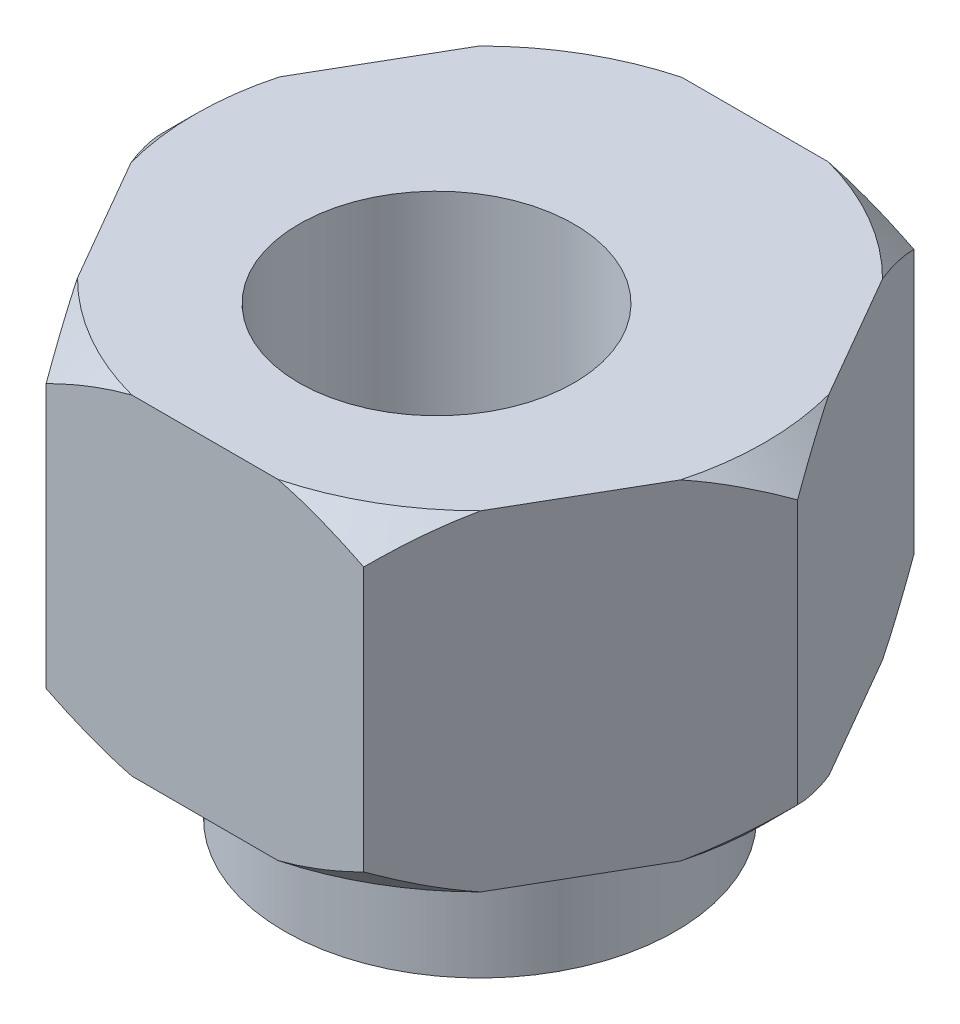
ISO-10303-21;
HEADER;
FILE_DESCRIPTION(('STEP AP214'),'2;1');
FILE_NAME('part.step','',(''),(''),'','','');
FILE_SCHEMA(('AUTOMOTIVE_DESIGN { 1 0 10303 214 1 1 1 1 }'));
ENDSEC;
DATA;
#1=APPLICATION_CONTEXT('core data for automotive mechanical design processes');
#2=APPLICATION_PROTOCOL_DEFINITION('international standard','automotive_design',2000,#1);
#3=PRODUCT_CONTEXT('',#1,'mechanical');
#4=PRODUCT('Part','Part','',(#3));
#5=PRODUCT_RELATED_PRODUCT_CATEGORY('part','',(#4));
#6=PRODUCT_DEFINITION_FORMATION('','',#4);
#7=PRODUCT_DEFINITION_CONTEXT('part definition',#1,'design');
#8=PRODUCT_DEFINITION('design','',#6,#7);
#9=PRODUCT_DEFINITION_SHAPE('','',#8);
#10=(LENGTH_UNIT() NAMED_UNIT(*) SI_UNIT(.MILLI.,.METRE.));
#11=(NAMED_UNIT(*) PLANE_ANGLE_UNIT() SI_UNIT($,.RADIAN.));
#12=(NAMED_UNIT(*) SI_UNIT($,.STERADIAN.) SOLID_ANGLE_UNIT());
#13=UNCERTAINTY_MEASURE_WITH_UNIT(LENGTH_MEASURE(1.E-05),#10,'distance_accuracy_value','');
#14=(GEOMETRIC_REPRESENTATION_CONTEXT(3) GLOBAL_UNCERTAINTY_ASSIGNED_CONTEXT((#13)) GLOBAL_UNIT_ASSIGNED_CONTEXT((#10,
#11,#12)) REPRESENTATION_CONTEXT('',''));
#15=CARTESIAN_POINT('',(0.,0.,0.));
#16=DIRECTION('',(0.,0.,1.));
#17=DIRECTION('',(1.,0.,0.));
#18=AXIS2_PLACEMENT_3D('',#15,#16,#17);
#19=CARTESIAN_POINT('',(0.,0.603600000033566,0.));
#20=DIRECTION('',(0.,1.,0.));
#21=DIRECTION('',(0.,0.,1.));
#22=AXIS2_PLACEMENT_3D('',#19,#20,#21);
#23=CONICAL_SURFACE('',#22,5.77710269197951,0.785398163397448);
#24=CARTESIAN_POINT('',(3.66583602411826,-4.45925382962046E-11,3.65058575400421));
#25=CARTESIAN_POINT('',(3.59819023816543,0.034740022256458,3.76775169219671));
#26=CARTESIAN_POINT('',(3.53117883640093,0.0741190546439248,3.88381884474099));
#27=CARTESIAN_POINT('',(3.39865378405298,0.160814558763776,4.11335896868467));
#28=CARTESIAN_POINT('',(3.33313646636913,0.20810850589876,4.22683829168825));
#29=CARTESIAN_POINT('',(3.20348247756349,0.309475567343877,4.45140558770323));
#30=CARTESIAN_POINT('',(3.13934511969438,0.363545213751609,4.56249475019585));
#31=CARTESIAN_POINT('',(3.01218041898829,0.477607203810078,4.78275047274827));
#32=CARTESIAN_POINT('',(2.94915669436118,0.537615735141677,4.89191076588474));
#33=CARTESIAN_POINT('',(2.88675134593849,0.599999999959958,5.0000000000167));
#34=B_SPLINE_CURVE_WITH_KNOTS('',3,(#24,#25,#26,#27,#28,#29,#30,#31,#32,#33),.UNSPECIFIED.,.F.,
.F.,(4,2,2,2,4),(0.,0.418851939634371,0.836531554095843,1.25399826048283,1.67263595625829),.UNSPECIFIED.);
#35=CARTESIAN_POINT('',(3.6658360240762,-2.29975708933372E-11,3.65058575408374));
#36=VERTEX_POINT('',#35);
#37=CARTESIAN_POINT('',(2.88675134595807,0.599999999955285,5.));
#38=VERTEX_POINT('',#37);
#39=EDGE_CURVE('E161',#36,#38,#34,.T.);
#40=ORIENTED_EDGE('',*,*,#39,.T.);
#41=CARTESIAN_POINT('',(2.88675134596664,0.599999999962989,4.99999999999376));
#42=CARTESIAN_POINT('',(2.76194064912218,0.537615735142946,4.99999999999775));
#43=CARTESIAN_POINT('',(2.63589319986819,0.477607203810566,4.9999999999994));
#44=CARTESIAN_POINT('',(2.38156379845602,0.363545213751467,5.0000000000006));
#45=CARTESIAN_POINT('',(2.25328908271759,0.309475567343881,5.00000000000017));
#46=CARTESIAN_POINT('',(1.99398110510648,0.208108505898969,4.99999999999983));
#47=CARTESIAN_POINT('',(1.8629464697392,0.160814558764041,4.99999999999991));
#48=CARTESIAN_POINT('',(1.59789636504229,0.0741190546438341,5.00000000000009));
#49=CARTESIAN_POINT('',(1.4638735615119,0.0347400222559553,5.00000000000017));
#50=CARTESIAN_POINT('',(1.32858198960276,-4.59149544066853E-11,5.));
#51=B_SPLINE_CURVE_WITH_KNOTS('',3,(#41,#42,#43,#44,#45,#46,#47,#48,#49,#50),.UNSPECIFIED.,.F.,
.F.,(4,2,2,2,4),(0.,0.418637695775641,0.836104402162777,1.25378401662423,1.67263595625861),.UNSPECIFIED.);
#52=CARTESIAN_POINT('',(1.32858198978154,0.,5.));
#53=VERTEX_POINT('',#52);
#54=EDGE_CURVE('E156',#38,#53,#51,.T.);
#55=ORIENTED_EDGE('',*,*,#54,.T.);
#56=CARTESIAN_POINT('',(0.,0.,0.));
#57=DIRECTION('',(0.,1.,0.));
#58=DIRECTION('',(0.,0.,1.));
#59=AXIS2_PLACEMENT_3D('',#56,#57,#58);
#60=CIRCLE('',#59,5.17350269194594);
#61=EDGE_CURVE('E21',#53,#36,#60,.T.);
#62=ORIENTED_EDGE('',*,*,#61,.T.);
#63=EDGE_LOOP('',(#40,#55,#62));
#64=FACE_BOUND('',#63,.T.);
#65=ADVANCED_FACE('F17',(#64),#23,.T.);
#66=CARTESIAN_POINT('',(0.,0.603600000033566,0.));
#67=DIRECTION('',(0.,1.,0.));
#68=DIRECTION('',(0.,0.,1.));
#69=AXIS2_PLACEMENT_3D('',#66,#67,#68);
#70=CONICAL_SURFACE('',#69,5.77710269197951,0.785398163397448);
#71=CARTESIAN_POINT('',(4.99441801372035,-4.45918489580247E-11,-1.34941424599245));
#72=CARTESIAN_POINT('',(5.06206379967688,0.0347400222564589,-1.23224830780208));
#73=CARTESIAN_POINT('',(5.1290752014429,0.074119054643926,-1.11618115525868));
#74=CARTESIAN_POINT('',(5.26160025379197,0.160814558763777,-0.886641031315653));
#75=CARTESIAN_POINT('',(5.32711757147541,0.208108505898761,-0.77316170831184));
#76=CARTESIAN_POINT('',(5.45677156028074,0.309475567343878,-0.548594412296683));
#77=CARTESIAN_POINT('',(5.52090891814993,0.36354521375161,-0.437505249804109));
#78=CARTESIAN_POINT('',(5.64807361885618,0.477607203810078,-0.217249527251782));
#79=CARTESIAN_POINT('',(5.71109734348336,0.537615735141677,-0.108089234115359));
#80=CARTESIAN_POINT('',(5.7735026919059,0.599999999959959,1.66975595881374E-11));
#81=B_SPLINE_CURVE_WITH_KNOTS('',3,(#71,#72,#73,#74,#75,#76,#77,#78,#79,#80),.UNSPECIFIED.,.F.,
.F.,(4,2,2,2,4),(0.,0.418851939634369,0.836531554095841,1.25399826048282,1.67263595625828),.UNSPECIFIED.);
#82=CARTESIAN_POINT('',(4.99441801376819,-2.29965721093256E-11,-1.34941424591626));
#83=VERTEX_POINT('',#82);
#84=CARTESIAN_POINT('',(5.77350269190123,0.599999999955286,-8.60786653237142E-12));
#85=VERTEX_POINT('',#84);
#86=EDGE_CURVE('E459',#83,#85,#81,.T.);
#87=ORIENTED_EDGE('',*,*,#86,.T.);
#88=CARTESIAN_POINT('',(5.77350269190011,0.599999999962989,-1.91471358696194E-11));
#89=CARTESIAN_POINT('',(5.71109734348134,0.537615735142945,0.108089234114184));
#90=CARTESIAN_POINT('',(5.64807361885576,0.477607203810565,0.217249527251194));
#91=CARTESIAN_POINT('',(5.52090891815072,0.363545213751465,0.437505249804027));
#92=CARTESIAN_POINT('',(5.45677156028114,0.30947556734388,0.548594412296522));
#93=CARTESIAN_POINT('',(5.32711757147529,0.208108505898967,0.773161708311531));
#94=CARTESIAN_POINT('',(5.26160025379172,0.160814558764039,0.886641031315274));
#95=CARTESIAN_POINT('',(5.12907520144341,0.074119054643832,1.11618115525861));
#96=CARTESIAN_POINT('',(5.06206379967829,0.0347400222559531,1.23224830780239));
#97=CARTESIAN_POINT('',(4.99441801372357,-4.59164677305028E-11,1.34941424599355));
#98=B_SPLINE_CURVE_WITH_KNOTS('',3,(#88,#89,#90,#91,#92,#93,#94,#95,#96,#97),.UNSPECIFIED.,.F.,
.F.,(4,2,2,2,4),(0.,0.418637695775644,0.836104402162782,1.25378401662423,1.67263595625862),.UNSPECIFIED.);
#99=CARTESIAN_POINT('',(4.99441801381297,0.,1.34941424583871));
#100=VERTEX_POINT('',#99);
#101=EDGE_CURVE('E212',#85,#100,#98,.T.);
#102=ORIENTED_EDGE('',*,*,#101,.T.);
#103=CARTESIAN_POINT('',(0.,0.,0.));
#104=DIRECTION('',(0.,1.,0.));
#105=DIRECTION('',(0.,0.,1.));
#106=AXIS2_PLACEMENT_3D('',#103,#104,#105);
#107=CIRCLE('',#106,5.17350269194594);
#108=EDGE_CURVE('E150',#100,#83,#107,.T.);
#109=ORIENTED_EDGE('',*,*,#108,.T.);
#110=EDGE_LOOP('',(#87,#102,#109));
#111=FACE_BOUND('',#110,.T.);
#112=ADVANCED_FACE('F668',(#111),#70,.T.);
#113=CARTESIAN_POINT('',(0.,0.603600000033566,0.));
#114=DIRECTION('',(0.,1.,0.));
#115=DIRECTION('',(0.,0.,1.));
#116=AXIS2_PLACEMENT_3D('',#113,#114,#115);
#117=CONICAL_SURFACE('',#116,5.77710269197951,0.785398163397448);
#118=CARTESIAN_POINT('',(1.32858198960209,-4.45921296185271E-11,-4.99999999999666));
#119=CARTESIAN_POINT('',(1.46387356151146,0.0347400222564594,-4.9999999999988));
#120=CARTESIAN_POINT('',(1.59789636504197,0.0741190546439264,-4.99999999999968));
#121=CARTESIAN_POINT('',(1.862946469739,0.160814558763777,-5.00000000000032));
#122=CARTESIAN_POINT('',(1.99398110510628,0.208108505898761,-5.00000000000009));
#123=CARTESIAN_POINT('',(2.25328908271725,0.309475567343878,-4.99999999999991));
#124=CARTESIAN_POINT('',(2.38156379845555,0.36354521375161,-4.99999999999995));
#125=CARTESIAN_POINT('',(2.63589319986789,0.477607203810078,-5.00000000000005));
#126=CARTESIAN_POINT('',(2.76194064912218,0.537615735141677,-5.00000000000009));
#127=CARTESIAN_POINT('',(2.88675134596741,0.599999999959958,-5.));
#128=B_SPLINE_CURVE_WITH_KNOTS('',3,(#118,#119,#120,#121,#122,#123,#124,#125,#126,#127),
.UNSPECIFIED.,.F.,.F.,(4,2,2,2,4),(0.,0.418851939634369,0.836531554095839,1.25399826048282,
1.67263595625828),.UNSPECIFIED.);
#129=CARTESIAN_POINT('',(1.328581989692,-2.29963572103143E-11,-5.));
#130=VERTEX_POINT('',#129);
#131=CARTESIAN_POINT('',(2.88675134594316,0.599999999955285,-5.00000000000861));
#132=VERTEX_POINT('',#131);
#133=EDGE_CURVE('E408',#130,#132,#128,.T.);
#134=ORIENTED_EDGE('',*,*,#133,.T.);
#135=CARTESIAN_POINT('',(2.88675134593348,0.599999999962988,-5.00000000001291));
#136=CARTESIAN_POINT('',(2.94915669435916,0.537615735142944,-4.89191076588356));
#137=CARTESIAN_POINT('',(3.01218041898758,0.477607203810565,-4.7827504727482));
#138=CARTESIAN_POINT('',(3.13934511969471,0.363545213751466,-4.56249475019658));
#139=CARTESIAN_POINT('',(3.20348247756355,0.30947556734388,-4.45140558770365));
#140=CARTESIAN_POINT('',(3.3331364663688,0.208108505898969,-4.2268382916883));
#141=CARTESIAN_POINT('',(3.39865378405252,0.16081455876404,-4.11335896868464));
#142=CARTESIAN_POINT('',(3.53117883640112,0.0741190546438333,-3.88381884474148));
#143=CARTESIAN_POINT('',(3.5981902381664,0.0347400222559543,-3.76775169219779));
#144=CARTESIAN_POINT('',(3.66583602412082,-4.59155251737993E-11,-3.65058575400646));
#145=B_SPLINE_CURVE_WITH_KNOTS('',3,(#135,#136,#137,#138,#139,#140,#141,#142,#143,#144),
.UNSPECIFIED.,.F.,.F.,(4,2,2,2,4),(0.,0.418637695775642,0.836104402162777,1.25378401662423,
1.67263595625861),.UNSPECIFIED.);
#146=CARTESIAN_POINT('',(3.66583602403142,0.,-3.6505857541613));
#147=VERTEX_POINT('',#146);
#148=EDGE_CURVE('E462',#132,#147,#145,.T.);
#149=ORIENTED_EDGE('',*,*,#148,.T.);
#150=CARTESIAN_POINT('',(0.,0.,0.));
#151=DIRECTION('',(0.,1.,0.));
#152=DIRECTION('',(0.,0.,1.));
#153=AXIS2_PLACEMENT_3D('',#150,#151,#152);
#154=CIRCLE('',#153,5.17350269194594);
#155=EDGE_CURVE('E534',#147,#130,#154,.T.);
#156=ORIENTED_EDGE('',*,*,#155,.T.);
#157=EDGE_LOOP('',(#134,#149,#156));
#158=FACE_BOUND('',#157,.T.);
#159=ADVANCED_FACE('F393',(#158),#117,.T.);
#160=CARTESIAN_POINT('',(0.,0.603600000033566,0.));
#161=DIRECTION('',(0.,1.,0.));
#162=DIRECTION('',(0.,0.,1.));
#163=AXIS2_PLACEMENT_3D('',#160,#161,#162);
#164=CONICAL_SURFACE('',#163,5.77710269197951,0.785398163397448);
#165=CARTESIAN_POINT('',(-3.66583602411826,-4.45912833102108E-11,-3.65058575400422));
#166=CARTESIAN_POINT('',(-3.59819023816542,0.0347400222564596,-3.76775169219672));
#167=CARTESIAN_POINT('',(-3.53117883640093,0.0741190546439267,-3.883818844741));
#168=CARTESIAN_POINT('',(-3.39865378405297,0.160814558763777,-4.11335896868467));
#169=CARTESIAN_POINT('',(-3.33313646636913,0.208108505898762,-4.22683829168826));
#170=CARTESIAN_POINT('',(-3.20348247756349,0.309475567343878,-4.45140558770323));
#171=CARTESIAN_POINT('',(-3.13934511969438,0.36354521375161,-4.56249475019585));
#172=CARTESIAN_POINT('',(-3.01218041898829,0.477607203810078,-4.78275047274827));
#173=CARTESIAN_POINT('',(-2.94915669436118,0.537615735141677,-4.89191076588474));
#174=CARTESIAN_POINT('',(-2.88675134593849,0.599999999959958,-5.0000000000167));
#175=B_SPLINE_CURVE_WITH_KNOTS('',3,(#165,#166,#167,#168,#169,#170,#171,#172,#173,#174),
.UNSPECIFIED.,.F.,.F.,(4,2,2,2,4),(0.,0.418851939634368,0.836531554095837,1.25399826048282,
1.67263595625828),.UNSPECIFIED.);
#176=CARTESIAN_POINT('',(-3.66583602407619,-2.29963239400847E-11,-3.65058575408375));
#177=VERTEX_POINT('',#176);
#178=CARTESIAN_POINT('',(-2.88675134595807,0.599999999955285,-5.));
#179=VERTEX_POINT('',#178);
#180=EDGE_CURVE('E382',#177,#179,#175,.T.);
#181=ORIENTED_EDGE('',*,*,#180,.T.);
#182=CARTESIAN_POINT('',(-2.88675134596664,0.599999999962987,-4.99999999999376));
#183=CARTESIAN_POINT('',(-2.76194064912218,0.537615735142943,-4.99999999999775));
#184=CARTESIAN_POINT('',(-2.63589319986819,0.477607203810564,-4.99999999999939));
#185=CARTESIAN_POINT('',(-2.38156379845602,0.363545213751465,-5.0000000000006));
#186=CARTESIAN_POINT('',(-2.25328908271759,0.309475567343879,-5.00000000000017));
#187=CARTESIAN_POINT('',(-1.99398110510648,0.208108505898967,-4.99999999999983));
#188=CARTESIAN_POINT('',(-1.8629464697392,0.160814558764038,-4.99999999999991));
#189=CARTESIAN_POINT('',(-1.59789636504229,0.0741190546438321,-5.00000000000009));
#190=CARTESIAN_POINT('',(-1.4638735615119,0.0347400222559533,-5.00000000000017));
#191=CARTESIAN_POINT('',(-1.32858198960276,-4.59168494863815E-11,-5.));
#192=B_SPLINE_CURVE_WITH_KNOTS('',3,(#182,#183,#184,#185,#186,#187,#188,#189,#190,#191),
.UNSPECIFIED.,.F.,.F.,(4,2,2,2,4),(0.,0.418637695775642,0.836104402162777,1.25378401662423,
1.67263595625861),.UNSPECIFIED.);
#193=CARTESIAN_POINT('',(-1.32858198978155,0.,-5.));
#194=VERTEX_POINT('',#193);
#195=EDGE_CURVE('E398',#179,#194,#192,.T.);
#196=ORIENTED_EDGE('',*,*,#195,.T.);
#197=CARTESIAN_POINT('',(0.,0.,0.));
#198=DIRECTION('',(0.,1.,0.));
#199=DIRECTION('',(0.,0.,1.));
#200=AXIS2_PLACEMENT_3D('',#197,#198,#199);
#201=CIRCLE('',#200,5.17350269194594);
#202=EDGE_CURVE('E535',#194,#177,#201,.T.);
#203=ORIENTED_EDGE('',*,*,#202,.T.);
#204=EDGE_LOOP('',(#181,#196,#203));
#205=FACE_BOUND('',#204,.T.);
#206=ADVANCED_FACE('F322',(#205),#164,.T.);
#207=CARTESIAN_POINT('',(0.,0.603600000033566,0.));
#208=DIRECTION('',(0.,1.,0.));
#209=DIRECTION('',(0.,0.,1.));
#210=AXIS2_PLACEMENT_3D('',#207,#208,#209);
#211=CONICAL_SURFACE('',#210,5.77710269197951,0.785398163397448);
#212=CARTESIAN_POINT('',(-1.32858198960209,-4.45906713783895E-11,4.99999999999666));
#213=CARTESIAN_POINT('',(-1.46387356151146,0.0347400222564604,4.9999999999988));
#214=CARTESIAN_POINT('',(-1.59789636504198,0.0741190546439275,4.99999999999968));
#215=CARTESIAN_POINT('',(-1.862946469739,0.160814558763778,5.00000000000032));
#216=CARTESIAN_POINT('',(-1.99398110510629,0.208108505898763,5.00000000000009));
#217=CARTESIAN_POINT('',(-2.25328908271726,0.30947556734388,4.99999999999991));
#218=CARTESIAN_POINT('',(-2.38156379845556,0.363545213751612,4.99999999999995));
#219=CARTESIAN_POINT('',(-2.63589319986789,0.47760720381008,5.00000000000005));
#220=CARTESIAN_POINT('',(-2.76194064912219,0.537615735141679,5.00000000000009));
#221=CARTESIAN_POINT('',(-2.88675134596742,0.599999999959962,5.));
#222=B_SPLINE_CURVE_WITH_KNOTS('',3,(#212,#213,#214,#215,#216,#217,#218,#219,#220,#221),
.UNSPECIFIED.,.F.,.F.,(4,2,2,2,4),(0.,0.41885193963437,0.836531554095841,1.25399826048282,
1.67263595625828),.UNSPECIFIED.);
#223=CARTESIAN_POINT('',(-1.328581989692,-2.29968905260717E-11,5.));
#224=VERTEX_POINT('',#223);
#225=CARTESIAN_POINT('',(-2.8867513459531,0.599999999960254,5.0000000000086));
#226=VERTEX_POINT('',#225);
#227=EDGE_CURVE('E159',#224,#226,#222,.T.);
#228=ORIENTED_EDGE('',*,*,#227,.T.);
#229=CARTESIAN_POINT('',(-2.88675134593348,0.599999999962986,5.00000000001291));
#230=CARTESIAN_POINT('',(-2.94915669435916,0.537615735142943,4.89191076588356));
#231=CARTESIAN_POINT('',(-3.01218041898758,0.477607203810564,4.7827504727482));
#232=CARTESIAN_POINT('',(-3.13934511969471,0.363545213751466,4.56249475019657));
#233=CARTESIAN_POINT('',(-3.20348247756355,0.309475567343881,4.45140558770365));
#234=CARTESIAN_POINT('',(-3.33313646636881,0.208108505898969,4.2268382916883));
#235=CARTESIAN_POINT('',(-3.39865378405252,0.16081455876404,4.11335896868464));
#236=CARTESIAN_POINT('',(-3.53117883640112,0.0741190546438334,3.88381884474148));
#237=CARTESIAN_POINT('',(-3.5981902381664,0.0347400222559549,3.76775169219779));
#238=CARTESIAN_POINT('',(-3.66583602412082,-4.59132321409068E-11,3.65058575400646));
#239=B_SPLINE_CURVE_WITH_KNOTS('',3,(#229,#230,#231,#232,#233,#234,#235,#236,#237,#238),
.UNSPECIFIED.,.F.,.F.,(4,2,2,2,4),(0.,0.41863769577564,0.836104402162774,1.25378401662422,
1.6726359562586),.UNSPECIFIED.);
#240=CARTESIAN_POINT('',(-3.66583602403143,0.,3.65058575416129));
#241=VERTEX_POINT('',#240);
#242=EDGE_CURVE('E346',#226,#241,#239,.T.);
#243=ORIENTED_EDGE('',*,*,#242,.T.);
#244=CARTESIAN_POINT('',(0.,0.,0.));
#245=DIRECTION('',(0.,1.,0.));
#246=DIRECTION('',(0.,0.,1.));
#247=AXIS2_PLACEMENT_3D('',#244,#245,#246);
#248=CIRCLE('',#247,5.17350269194594);
#249=EDGE_CURVE('E162',#241,#224,#248,.T.);
#250=ORIENTED_EDGE('',*,*,#249,.T.);
#251=EDGE_LOOP('',(#228,#243,#250));
#252=FACE_BOUND('',#251,.T.);
#253=ADVANCED_FACE('F317',(#252),#211,.T.);
#254=CARTESIAN_POINT('',(0.,0.603600000033566,0.));
#255=DIRECTION('',(0.,1.,0.));
#256=DIRECTION('',(0.,0.,1.));
#257=AXIS2_PLACEMENT_3D('',#254,#255,#256);
#258=CONICAL_SURFACE('',#257,5.77710269197951,0.785398163397448);
#259=CARTESIAN_POINT('',(-4.99441801372035,-4.4589830444133E-11,1.34941424599245));
#260=CARTESIAN_POINT('',(-5.06206379967688,0.0347400222564606,1.23224830780208));
#261=CARTESIAN_POINT('',(-5.1290752014429,0.0741190546439278,1.11618115525868));
#262=CARTESIAN_POINT('',(-5.26160025379197,0.160814558763779,0.886641031315649));
#263=CARTESIAN_POINT('',(-5.32711757147542,0.208108505898763,0.773161708311836));
#264=CARTESIAN_POINT('',(-5.45677156028074,0.30947556734388,0.548594412296679));
#265=CARTESIAN_POINT('',(-5.52090891814993,0.363545213751612,0.437505249804105));
#266=CARTESIAN_POINT('',(-5.64807361885618,0.477607203810079,0.217249527251778));
#267=CARTESIAN_POINT('',(-5.71109734348336,0.537615735141678,0.108089234115355));
#268=CARTESIAN_POINT('',(-5.7735026919059,0.59999999995996,-1.67010240086028E-11));
#269=B_SPLINE_CURVE_WITH_KNOTS('',3,(#259,#260,#261,#262,#263,#264,#265,#266,#267,#268),
.UNSPECIFIED.,.F.,.F.,(4,2,2,2,4),(0.,0.418851939634369,0.836531554095839,1.25399826048282,
1.67263595625828),.UNSPECIFIED.);
#270=CARTESIAN_POINT('',(-4.99441801376819,-2.29957455403525E-11,1.34941424591626));
#271=VERTEX_POINT('',#270);
#272=CARTESIAN_POINT('',(-5.77350269190123,0.599999999955286,8.60283778239998E-12));
#273=VERTEX_POINT('',#272);
#274=EDGE_CURVE('E338',#271,#273,#269,.T.);
#275=ORIENTED_EDGE('',*,*,#274,.T.);
#276=CARTESIAN_POINT('',(-5.77350269190011,0.599999999962986,1.91425988684888E-11));
#277=CARTESIAN_POINT('',(-5.71109734348133,0.537615735142943,-0.108089234114188));
#278=CARTESIAN_POINT('',(-5.64807361885576,0.477607203810564,-0.217249527251197));
#279=CARTESIAN_POINT('',(-5.52090891815072,0.363545213751465,-0.437505249804028));
#280=CARTESIAN_POINT('',(-5.45677156028113,0.30947556734388,-0.548594412296522));
#281=CARTESIAN_POINT('',(-5.32711757147529,0.208108505898968,-0.77316170831153));
#282=CARTESIAN_POINT('',(-5.26160025379172,0.160814558764039,-0.886641031315272));
#283=CARTESIAN_POINT('',(-5.12907520144342,0.0741190546438328,-1.1161811552586));
#284=CARTESIAN_POINT('',(-5.06206379967829,0.0347400222559541,-1.23224830780238));
#285=CARTESIAN_POINT('',(-4.99441801372357,-4.59155080160236E-11,-1.34941424599354));
#286=B_SPLINE_CURVE_WITH_KNOTS('',3,(#276,#277,#278,#279,#280,#281,#282,#283,#284,#285),
.UNSPECIFIED.,.F.,.F.,(4,2,2,2,4),(0.,0.418637695775641,0.836104402162776,1.25378401662423,
1.67263595625861),.UNSPECIFIED.);
#287=CARTESIAN_POINT('',(-4.99441801381297,0.,-1.34941424583871));
#288=VERTEX_POINT('',#287);
#289=EDGE_CURVE('E330',#273,#288,#286,.T.);
#290=ORIENTED_EDGE('',*,*,#289,.T.);
#291=CARTESIAN_POINT('',(0.,0.,0.));
#292=DIRECTION('',(0.,1.,0.));
#293=DIRECTION('',(0.,0.,1.));
#294=AXIS2_PLACEMENT_3D('',#291,#292,#293);
#295=CIRCLE('',#294,5.17350269194594);
#296=EDGE_CURVE('E164',#288,#271,#295,.T.);
#297=ORIENTED_EDGE('',*,*,#296,.T.);
#298=EDGE_LOOP('',(#275,#290,#297));
#299=FACE_BOUND('',#298,.T.);
#300=ADVANCED_FACE('F313',(#299),#258,.T.);
#301=CARTESIAN_POINT('',(0.,0.,0.));
#302=DIRECTION('',(0.,1.,0.));
#303=DIRECTION('',(0.,0.,1.));
#304=AXIS2_PLACEMENT_3D('',#301,#302,#303);
#305=PLANE('',#304);
#306=CARTESIAN_POINT('',(0.,0.,0.));
#307=DIRECTION('',(0.,1.,0.));
#308=DIRECTION('',(0.,0.,1.));
#309=AXIS2_PLACEMENT_3D('',#306,#307,#308);
#310=CIRCLE('',#309,3.555);
#311=CARTESIAN_POINT('',(0.,0.,3.555));
#312=VERTEX_POINT('',#311);
#313=EDGE_CURVE('E268',#312,#312,#310,.F.);
#314=ORIENTED_EDGE('',*,*,#313,.F.);
#315=EDGE_LOOP('',(#314));
#316=FACE_BOUND('',#315,.T.);
#317=ORIENTED_EDGE('',*,*,#249,.F.);
#318=DIRECTION('',(-0.5,0.,-0.866025403784439));
#319=VECTOR('',#318,1.);
#320=CARTESIAN_POINT('',(-5.77350269189626,0.,0.));
#321=LINE('',#320,#319);
#322=EDGE_CURVE('E345',#241,#271,#321,.T.);
#323=ORIENTED_EDGE('',*,*,#322,.T.);
#324=ORIENTED_EDGE('',*,*,#296,.F.);
#325=DIRECTION('',(0.5,0.,-0.866025403784439));
#326=VECTOR('',#325,1.);
#327=CARTESIAN_POINT('',(-2.88675134594813,0.,-5.));
#328=LINE('',#327,#326);
#329=EDGE_CURVE('E389',#288,#177,#328,.T.);
#330=ORIENTED_EDGE('',*,*,#329,.T.);
#331=ORIENTED_EDGE('',*,*,#202,.F.);
#332=DIRECTION('',(1.,0.,0.));
#333=VECTOR('',#332,1.);
#334=CARTESIAN_POINT('',(2.88675134594813,0.,-5.));
#335=LINE('',#334,#333);
#336=EDGE_CURVE('E406',#194,#130,#335,.T.);
#337=ORIENTED_EDGE('',*,*,#336,.T.);
#338=ORIENTED_EDGE('',*,*,#155,.F.);
#339=DIRECTION('',(0.5,0.,0.866025403784438));
#340=VECTOR('',#339,1.);
#341=CARTESIAN_POINT('',(5.77350269189626,0.,0.));
#342=LINE('',#341,#340);
#343=EDGE_CURVE('E460',#147,#83,#342,.T.);
#344=ORIENTED_EDGE('',*,*,#343,.T.);
#345=ORIENTED_EDGE('',*,*,#108,.F.);
#346=DIRECTION('',(-0.5,0.,0.866025403784439));
#347=VECTOR('',#346,1.);
#348=CARTESIAN_POINT('',(2.88675134594813,0.,5.));
#349=LINE('',#348,#347);
#350=EDGE_CURVE('E145',#100,#36,#349,.T.);
#351=ORIENTED_EDGE('',*,*,#350,.T.);
#352=ORIENTED_EDGE('',*,*,#61,.F.);
#353=DIRECTION('',(-1.,0.,0.));
#354=VECTOR('',#353,1.);
#355=CARTESIAN_POINT('',(-2.88675134594813,0.,5.));
#356=LINE('',#355,#354);
#357=EDGE_CURVE('E143',#53,#224,#356,.T.);
#358=ORIENTED_EDGE('',*,*,#357,.T.);
#359=EDGE_LOOP('',(#317,#323,#324,#330,#331,#337,#338,#344,#345,#351,#352,#358));
#360=FACE_BOUND('',#359,.T.);
#361=ADVANCED_FACE('F142',(#316,#360),#305,.F.);
#362=CARTESIAN_POINT('',(-2.88675134594813,6.,5.));
#363=DIRECTION('',(0.,0.,-1.));
#364=DIRECTION('',(-1.,0.,0.));
#365=AXIS2_PLACEMENT_3D('',#362,#363,#364);
#366=PLANE('',#365);
#367=CARTESIAN_POINT('',(-2.88675127240782,5.40000003673446,5.));
#368=CARTESIAN_POINT('',(-2.76194058122539,5.46238429752763,5.));
#369=CARTESIAN_POINT('',(-2.63589313773684,5.52239282497906,5.));
#370=CARTESIAN_POINT('',(-2.38156374804995,5.63645480772306,5.));
#371=CARTESIAN_POINT('',(-2.25328903827018,5.69052445069416,5.));
#372=CARTESIAN_POINT('',(-1.99398107285085,5.79189150581332,5.));
#373=CARTESIAN_POINT('',(-1.86294644371698,5.83918545005971,5.));
#374=CARTESIAN_POINT('',(-1.59789635179376,5.92588094911435,5.));
#375=CARTESIAN_POINT('',(-1.4638735548049,5.96525997932887,5.));
#376=CARTESIAN_POINT('',(-1.32858198956925,5.99999999991264,5.));
#377=B_SPLINE_CURVE_WITH_KNOTS('',3,(#367,#368,#369,#370,#371,#372,#373,#374,#375,#376),
.UNSPECIFIED.,.F.,.F.,(4,2,2,2,4),(0.,0.418637675173099,0.836104361098579,1.2537839550608,
1.67263587405466),.UNSPECIFIED.);
#378=CARTESIAN_POINT('',(-2.88675133887262,5.39999999288879,5.00000001225515));
#379=VERTEX_POINT('',#378);
#380=CARTESIAN_POINT('',(-1.32858198956542,5.99999999991362,5.));
#381=VERTEX_POINT('',#380);
#382=EDGE_CURVE('E190',#379,#381,#377,.T.);
#383=ORIENTED_EDGE('',*,*,#382,.F.);
#384=DIRECTION('',(0.,1.,0.));
#385=VECTOR('',#384,1.);
#386=CARTESIAN_POINT('',(-2.88675134594813,6.,5.));
#387=LINE('',#386,#385);
#388=EDGE_CURVE('E353',#379,#226,#387,.F.);
#389=ORIENTED_EDGE('',*,*,#388,.T.);
#390=ORIENTED_EDGE('',*,*,#227,.F.);
#391=ORIENTED_EDGE('',*,*,#357,.F.);
#392=ORIENTED_EDGE('',*,*,#54,.F.);
#393=DIRECTION('',(0.,1.,0.));
#394=VECTOR('',#393,1.);
#395=CARTESIAN_POINT('',(2.88675134594813,6.,5.));
#396=LINE('',#395,#394);
#397=CARTESIAN_POINT('',(2.88675135372977,5.39999999714048,4.99999999876794));
#398=VERTEX_POINT('',#397);
#399=EDGE_CURVE('E240',#38,#398,#396,.T.);
#400=ORIENTED_EDGE('',*,*,#399,.T.);
#401=CARTESIAN_POINT('',(1.32858198957231,5.99999999991876,5.00000000001543));
#402=CARTESIAN_POINT('',(1.46387356276356,5.96525997728714,5.00000000000557));
#403=CARTESIAN_POINT('',(1.59789636755175,5.92588094448492,5.0000000000015));
#404=CARTESIAN_POINT('',(1.86294647470605,5.83918543940044,4.99999999999851));
#405=CARTESIAN_POINT('',(1.99398111127317,5.79189149171627,4.99999999999958));
#406=CARTESIAN_POINT('',(2.2532890912313,5.69052442906689,5.00000000000043));
#407=CARTESIAN_POINT('',(2.38156380811698,5.63645478200421,5.00000000000021));
#408=CARTESIAN_POINT('',(2.63589321178753,5.52239279055128,4.99999999999979));
#409=CARTESIAN_POINT('',(2.76194066215243,5.46238425847972,4.99999999999957));
#410=CARTESIAN_POINT('',(2.88675136008875,5.399999992894,5.));
#411=B_SPLINE_CURVE_WITH_KNOTS('',3,(#401,#402,#403,#404,#405,#406,#407,#408,#409,#410),
.UNSPECIFIED.,.F.,.F.,(4,2,2,2,4),(0.,0.418851943600102,0.836531562000566,1.25399827231968,
1.67263597205397),.UNSPECIFIED.);
#412=CARTESIAN_POINT('',(1.32858198939985,5.99999999995614,5.));
#413=VERTEX_POINT('',#412);
#414=EDGE_CURVE('E199',#413,#398,#411,.T.);
#415=ORIENTED_EDGE('',*,*,#414,.F.);
#416=DIRECTION('',(1.,0.,0.));
#417=VECTOR('',#416,1.);
#418=CARTESIAN_POINT('',(0.,6.,5.));
#419=LINE('',#418,#417);
#420=EDGE_CURVE('E267',#381,#413,#419,.T.);
#421=ORIENTED_EDGE('',*,*,#420,.F.);
#422=EDGE_LOOP('',(#383,#389,#390,#391,#392,#400,#415,#421));
#423=FACE_BOUND('',#422,.T.);
#424=ADVANCED_FACE('F154',(#423),#366,.F.);
#425=CARTESIAN_POINT('',(0.,5.39639999999508,0.));
#426=DIRECTION('',(0.,-1.,0.));
#427=DIRECTION('',(0.,0.,-1.));
#428=AXIS2_PLACEMENT_3D('',#425,#426,#427);
#429=CONICAL_SURFACE('',#428,5.77710269186582,0.785398163444535);
#430=CARTESIAN_POINT('',(0.,5.99999999991496,0.));
#431=DIRECTION('',(0.,-1.,0.));
#432=DIRECTION('',(0.,0.,-1.));
#433=AXIS2_PLACEMENT_3D('',#430,#431,#432);
#434=CIRCLE('',#433,5.1735026918891);
#435=CARTESIAN_POINT('',(3.66583602413975,5.99999999991375,3.65058575397367));
#436=VERTEX_POINT('',#435);
#437=EDGE_CURVE('E265',#413,#436,#434,.F.);
#438=ORIENTED_EDGE('',*,*,#437,.F.);
#439=ORIENTED_EDGE('',*,*,#414,.T.);
#440=CARTESIAN_POINT('',(2.88675134737079,5.40000000138697,4.99999999753588));
#441=CARTESIAN_POINT('',(2.9491566956848,5.46238426604447,4.89191076359199));
#442=CARTESIAN_POINT('',(3.01218042020127,5.52239279722098,4.78275047064724));
#443=CARTESIAN_POINT('',(3.13934512068219,5.63645478698672,4.56249474848501));
#444=CARTESIAN_POINT('',(3.20348247843679,5.69052443325672,4.45140558619081));
#445=CARTESIAN_POINT('',(3.33313646700768,5.79189149444767,4.22683829058207));
#446=CARTESIAN_POINT('',(3.39865378457128,5.83918544146626,4.1133589677863));
#447=CARTESIAN_POINT('',(3.53117883667346,5.92588094538169,3.88381884426961));
#448=CARTESIAN_POINT('',(3.59819023831241,5.96525997768128,3.76775169194455));
#449=CARTESIAN_POINT('',(3.66583602413804,5.99999999991288,3.65058575397663));
#450=B_SPLINE_CURVE_WITH_KNOTS('',3,(#440,#441,#442,#443,#444,#445,#446,#447,#448,#449),
.UNSPECIFIED.,.F.,.F.,(4,2,2,2,4),(0.,0.418637694976627,0.836104400570385,1.25378401423708,
1.67263595307105),.UNSPECIFIED.);
#451=EDGE_CURVE('E205',#398,#436,#450,.T.);
#452=ORIENTED_EDGE('',*,*,#451,.T.);
#453=EDGE_LOOP('',(#438,#439,#452));
#454=FACE_BOUND('',#453,.T.);
#455=ADVANCED_FACE('F183',(#454),#429,.T.);
#456=CARTESIAN_POINT('',(2.88675134594813,6.,5.));
#457=DIRECTION('',(-0.866025403784439,0.,-0.5));
#458=DIRECTION('',(-0.5,0.,0.866025403784439));
#459=AXIS2_PLACEMENT_3D('',#456,#457,#458);
#460=PLANE('',#459);
#461=ORIENTED_EDGE('',*,*,#39,.F.);
#462=ORIENTED_EDGE('',*,*,#350,.F.);
#463=ORIENTED_EDGE('',*,*,#101,.F.);
#464=DIRECTION('',(0.,1.,0.));
#465=VECTOR('',#464,1.);
#466=CARTESIAN_POINT('',(5.77350269189626,6.,0.));
#467=LINE('',#466,#465);
#468=CARTESIAN_POINT('',(5.77350269472008,5.39999999714048,-7.34496741977299E-09));
#469=VERTEX_POINT('',#468);
#470=EDGE_CURVE('E456',#85,#469,#467,.T.);
#471=ORIENTED_EDGE('',*,*,#470,.T.);
#472=CARTESIAN_POINT('',(4.9944180137217,5.99999999991876,1.34941424602763));
#473=CARTESIAN_POINT('',(5.06206380030825,5.96525997728742,1.23224830672204));
#474=CARTESIAN_POINT('',(5.1290752026983,5.92588094448554,1.11618115308789));
#475=CARTESIAN_POINT('',(5.26160025627185,5.83918543940187,0.88664102701675));
#476=CARTESIAN_POINT('',(5.32711757455583,5.79189149171816,0.773161702975357));
#477=CARTESIAN_POINT('',(5.45677156453467,5.69052442906978,0.5485944049297));
#478=CARTESIAN_POINT('',(5.52090892297685,5.63645478200765,0.437505241444157));
#479=CARTESIAN_POINT('',(5.64807362481082,5.52239279055589,0.217249516937519));
#480=CARTESIAN_POINT('',(5.71109734999262,5.46238425848495,0.108089222839946));
#481=CARTESIAN_POINT('',(5.7735026989607,5.39999999289986,-1.22359750520526E-08));
#482=B_SPLINE_CURVE_WITH_KNOTS('',3,(#472,#473,#474,#475,#476,#477,#478,#479,#480,#481),
.UNSPECIFIED.,.F.,.F.,(4,2,2,2,4),(0.,0.418851943596812,0.836531561994007,1.25399827230986,
1.67263597204086),.UNSPECIFIED.);
#483=CARTESIAN_POINT('',(4.99441801362212,5.99999999995614,1.34941424616926));
#484=VERTEX_POINT('',#483);
#485=EDGE_CURVE('E230',#484,#469,#482,.T.);
#486=ORIENTED_EDGE('',*,*,#485,.F.);
#487=DIRECTION('',(0.499999999999997,0.,-0.86602540378444));
#488=VECTOR('',#487,1.);
#489=CARTESIAN_POINT('',(3.66583602412816,6.,3.65058575399375));
#490=LINE('',#489,#488);
#491=EDGE_CURVE('E264',#436,#484,#490,.T.);
#492=ORIENTED_EDGE('',*,*,#491,.F.);
#493=ORIENTED_EDGE('',*,*,#451,.F.);
#494=ORIENTED_EDGE('',*,*,#399,.F.);
#495=EDGE_LOOP('',(#461,#462,#463,#471,#486,#492,#493,#494));
#496=FACE_BOUND('',#495,.T.);
#497=ADVANCED_FACE('F218',(#496),#460,.F.);
#498=CARTESIAN_POINT('',(0.,5.39639999999508,0.));
#499=DIRECTION('',(0.,-1.,0.));
#500=DIRECTION('',(0.,0.,-1.));
#501=AXIS2_PLACEMENT_3D('',#498,#499,#500);
#502=CONICAL_SURFACE('',#501,5.77710269186582,0.785398163444535);
#503=CARTESIAN_POINT('',(0.,5.99999999991496,0.));
#504=DIRECTION('',(0.,-1.,0.));
#505=DIRECTION('',(0.,0.,-1.));
#506=AXIS2_PLACEMENT_3D('',#503,#504,#505);
#507=CIRCLE('',#506,5.1735026918891);
#508=CARTESIAN_POINT('',(4.99441801370465,5.99999999991375,-1.34941424602632));
#509=VERTEX_POINT('',#508);
#510=EDGE_CURVE('E262',#484,#509,#507,.F.);
#511=ORIENTED_EDGE('',*,*,#510,.F.);
#512=ORIENTED_EDGE('',*,*,#485,.T.);
#513=CARTESIAN_POINT('',(5.77350269047947,5.4000000013811,-2.4539595269157E-09));
#514=CARTESIAN_POINT('',(5.71109734216501,5.46238426603924,-0.108089236398635));
#515=CARTESIAN_POINT('',(5.64807361764808,5.52239279721637,-0.217249529344181));
#516=CARTESIAN_POINT('',(5.52090891716622,5.63645478698328,-0.437505251508035));
#517=CARTESIAN_POINT('',(5.45677155941114,5.69052443325382,-0.548594413803053));
#518=CARTESIAN_POINT('',(5.32711757083928,5.79189149444579,-0.77316170941348));
#519=CARTESIAN_POINT('',(5.26160025327519,5.83918544146483,-0.886641032210107));
#520=CARTESIAN_POINT('',(5.12907520117199,5.92588094538106,-1.11618115572856));
#521=CARTESIAN_POINT('',(5.06206379953252,5.965259977681,-1.23224830805453));
#522=CARTESIAN_POINT('',(4.99441801370635,5.99999999991288,-1.34941424602337));
#523=B_SPLINE_CURVE_WITH_KNOTS('',3,(#513,#514,#515,#516,#517,#518,#519,#520,#521,#522),
.UNSPECIFIED.,.F.,.F.,(4,2,2,2,4),(0.,0.418637694979914,0.836104400576935,1.2537840142469,
1.67263595308417),.UNSPECIFIED.);
#524=EDGE_CURVE('E467',#469,#509,#523,.T.);
#525=ORIENTED_EDGE('',*,*,#524,.T.);
#526=EDGE_LOOP('',(#511,#512,#525));
#527=FACE_BOUND('',#526,.T.);
#528=ADVANCED_FACE('F222',(#527),#502,.T.);
#529=CARTESIAN_POINT('',(5.77350269189626,6.,0.));
#530=DIRECTION('',(-0.866025403784438,0.,0.5));
#531=DIRECTION('',(0.5,0.,0.866025403784438));
#532=AXIS2_PLACEMENT_3D('',#529,#530,#531);
#533=PLANE('',#532);
#534=ORIENTED_EDGE('',*,*,#86,.F.);
#535=ORIENTED_EDGE('',*,*,#343,.F.);
#536=ORIENTED_EDGE('',*,*,#148,.F.);
#537=DIRECTION('',(0.,1.,0.));
#538=VECTOR('',#537,1.);
#539=CARTESIAN_POINT('',(2.88675134594813,6.,-5.));
#540=LINE('',#539,#538);
#541=CARTESIAN_POINT('',(2.88675134098684,5.39999999714048,-5.00000000612508));
#542=VERTEX_POINT('',#541);
#543=EDGE_CURVE('E435',#132,#542,#540,.T.);
#544=ORIENTED_EDGE('',*,*,#543,.T.);
#545=CARTESIAN_POINT('',(3.6658360241494,5.99999999991876,-3.6505857539878));
#546=CARTESIAN_POINT('',(3.59819023754501,5.96525997728703,-3.76775169328484));
#547=CARTESIAN_POINT('',(3.53117883514718,5.92588094448466,-3.88381884691619));
#548=CARTESIAN_POINT('',(3.39865378156702,5.83918543939984,-4.11335897298685));
#549=CARTESIAN_POINT('',(3.33313646328417,5.79189149171548,-4.22683829703053));
#550=CARTESIAN_POINT('',(3.20348247330544,5.69052442906568,-4.45140559507943));
#551=CARTESIAN_POINT('',(3.13934511486221,5.63645478200277,-4.56249475856592));
#552=CARTESIAN_POINT('',(3.01218041302618,5.52239279054936,-4.78275048307443));
#553=CARTESIAN_POINT('',(2.94915668784335,5.46238425847754,-4.89191077717292));
#554=CARTESIAN_POINT('',(2.88675133887537,5.39999999289155,-5.00000001225038));
#555=B_SPLINE_CURVE_WITH_KNOTS('',3,(#545,#546,#547,#548,#549,#550,#551,#552,#553,#554),
.UNSPECIFIED.,.F.,.F.,(4,2,2,2,4),(0.,0.418851943601478,0.836531562003308,1.25399827232378,
1.67263597205945),.UNSPECIFIED.);
#556=CARTESIAN_POINT('',(3.66583602422227,5.99999999995614,-3.65058575383074));
#557=VERTEX_POINT('',#556);
#558=EDGE_CURVE('E458',#557,#542,#555,.T.);
#559=ORIENTED_EDGE('',*,*,#558,.F.);
#560=DIRECTION('',(-0.5,0.,-0.866025403784439));
#561=VECTOR('',#560,1.);
#562=CARTESIAN_POINT('',(4.99441801371623,6.,-1.34941424600625));
#563=LINE('',#562,#561);
#564=EDGE_CURVE('E261',#509,#557,#563,.T.);
#565=ORIENTED_EDGE('',*,*,#564,.F.);
#566=ORIENTED_EDGE('',*,*,#524,.F.);
#567=ORIENTED_EDGE('',*,*,#470,.F.);
#568=EDGE_LOOP('',(#534,#535,#536,#544,#559,#565,#566,#567));
#569=FACE_BOUND('',#568,.T.);
#570=ADVANCED_FACE('F484',(#569),#533,.F.);
#571=CARTESIAN_POINT('',(0.,5.39639999999508,0.));
#572=DIRECTION('',(0.,-1.,0.));
#573=DIRECTION('',(0.,0.,-1.));
#574=AXIS2_PLACEMENT_3D('',#571,#572,#573);
#575=CONICAL_SURFACE('',#574,5.77710269186582,0.785398163444535);
#576=CARTESIAN_POINT('',(0.,5.99999999991496,0.));
#577=DIRECTION('',(0.,-1.,0.));
#578=DIRECTION('',(0.,0.,-1.));
#579=AXIS2_PLACEMENT_3D('',#576,#577,#578);
#580=CIRCLE('',#579,5.1735026918891);
#581=CARTESIAN_POINT('',(1.32858198956491,5.99999999991375,-5.));
#582=VERTEX_POINT('',#581);
#583=EDGE_CURVE('E259',#557,#582,#580,.F.);
#584=ORIENTED_EDGE('',*,*,#583,.F.);
#585=ORIENTED_EDGE('',*,*,#558,.T.);
#586=CARTESIAN_POINT('',(2.88675134309817,5.40000000138928,-5.));
#587=CARTESIAN_POINT('',(2.76194064647052,5.46238426604653,-5.));
#588=CARTESIAN_POINT('',(2.63589319743794,5.5223927972228,-5.));
#589=CARTESIAN_POINT('',(2.38156379647684,5.63645478698808,-5.));
#590=CARTESIAN_POINT('',(2.25328908096801,5.69052443325786,-5.));
#591=CARTESIAN_POINT('',(1.99398110382699,5.79189149444842,-5.));
#592=CARTESIAN_POINT('',(1.8629464687002,5.83918544146682,-5.));
#593=CARTESIAN_POINT('',(1.59789636449664,5.92588094538193,-5.));
#594=CARTESIAN_POINT('',(1.46387356121916,5.96525997768139,-5.));
#595=CARTESIAN_POINT('',(1.32858198956832,5.99999999991288,-5.));
#596=B_SPLINE_CURVE_WITH_KNOTS('',3,(#586,#587,#588,#589,#590,#591,#592,#593,#594,#595),
.UNSPECIFIED.,.F.,.F.,(4,2,2,2,4),(0.,0.418637694975328,0.836104400567795,1.2537840142332,
1.67263595306587),.UNSPECIFIED.);
#597=EDGE_CURVE('E407',#542,#582,#596,.T.);
#598=ORIENTED_EDGE('',*,*,#597,.T.);
#599=EDGE_LOOP('',(#584,#585,#598));
#600=FACE_BOUND('',#599,.T.);
#601=ADVANCED_FACE('F423',(#600),#575,.T.);
#602=CARTESIAN_POINT('',(2.88675134594813,6.,-5.));
#603=DIRECTION('',(0.,0.,1.));
#604=DIRECTION('',(1.,0.,0.));
#605=AXIS2_PLACEMENT_3D('',#602,#603,#604);
#606=PLANE('',#605);
#607=ORIENTED_EDGE('',*,*,#133,.F.);
#608=ORIENTED_EDGE('',*,*,#336,.F.);
#609=ORIENTED_EDGE('',*,*,#195,.F.);
#610=DIRECTION('',(0.,1.,0.));
#611=VECTOR('',#610,1.);
#612=CARTESIAN_POINT('',(-2.88675134594813,6.,-5.));
#613=LINE('',#612,#611);
#614=CARTESIAN_POINT('',(-2.88675135373325,5.39999999714048,-4.99999999876593));
#615=VERTEX_POINT('',#614);
#616=EDGE_CURVE('E388',#179,#615,#613,.T.);
#617=ORIENTED_EDGE('',*,*,#616,.T.);
#618=CARTESIAN_POINT('',(-1.32858198957231,5.99999999991876,-5.00000000001543));
#619=CARTESIAN_POINT('',(-1.463873562764,5.96525997728703,-5.00000000000556));
#620=CARTESIAN_POINT('',(-1.59789636755263,5.92588094448466,-5.00000000000149));
#621=CARTESIAN_POINT('',(-1.86294647470778,5.83918543939984,-4.99999999999851));
#622=CARTESIAN_POINT('',(-1.99398111127531,5.79189149171548,-4.99999999999957));
#623=CARTESIAN_POINT('',(-2.25328909123426,5.69052442906568,-5.00000000000042));
#624=CARTESIAN_POINT('',(-2.38156380812034,5.63645478200277,-5.00000000000021));
#625=CARTESIAN_POINT('',(-2.63589321179167,5.52239279054936,-4.99999999999978));
#626=CARTESIAN_POINT('',(-2.76194066215695,5.46238425847754,-4.99999999999957));
#627=CARTESIAN_POINT('',(-2.88675136009365,5.39999999289155,-5.));
#628=B_SPLINE_CURVE_WITH_KNOTS('',3,(#618,#619,#620,#621,#622,#623,#624,#625,#626,#627),
.UNSPECIFIED.,.F.,.F.,(4,2,2,2,4),(0.,0.418851943601477,0.836531562003306,1.25399827232378,
1.67263597205944),.UNSPECIFIED.);
#629=CARTESIAN_POINT('',(-1.32858198939985,5.99999999995614,-5.));
#630=VERTEX_POINT('',#629);
#631=EDGE_CURVE('E429',#630,#615,#628,.T.);
#632=ORIENTED_EDGE('',*,*,#631,.F.);
#633=DIRECTION('',(1.,0.,0.));
#634=VECTOR('',#633,1.);
#635=CARTESIAN_POINT('',(0.,6.,-5.));
#636=LINE('',#635,#634);
#637=EDGE_CURVE('E258',#582,#630,#636,.F.);
#638=ORIENTED_EDGE('',*,*,#637,.F.);
#639=ORIENTED_EDGE('',*,*,#597,.F.);
#640=ORIENTED_EDGE('',*,*,#543,.F.);
#641=EDGE_LOOP('',(#607,#608,#609,#617,#632,#638,#639,#640));
#642=FACE_BOUND('',#641,.T.);
#643=ADVANCED_FACE('F420',(#642),#606,.F.);
#644=CARTESIAN_POINT('',(0.,5.39639999999508,0.));
#645=DIRECTION('',(0.,-1.,0.));
#646=DIRECTION('',(0.,0.,-1.));
#647=AXIS2_PLACEMENT_3D('',#644,#645,#646);
#648=CONICAL_SURFACE('',#647,5.77710269186582,0.785398163444535);
#649=CARTESIAN_POINT('',(0.,5.99999999991496,0.));
#650=DIRECTION('',(0.,-1.,0.));
#651=DIRECTION('',(0.,0.,-1.));
#652=AXIS2_PLACEMENT_3D('',#649,#650,#651);
#653=CIRCLE('',#652,5.1735026918891);
#654=CARTESIAN_POINT('',(-3.66583602413974,5.99999999991375,-3.65058575397368));
#655=VERTEX_POINT('',#654);
#656=EDGE_CURVE('E256',#630,#655,#653,.F.);
#657=ORIENTED_EDGE('',*,*,#656,.F.);
#658=ORIENTED_EDGE('',*,*,#631,.T.);
#659=CARTESIAN_POINT('',(-2.88675134737311,5.40000000138929,-4.99999999753186));
#660=CARTESIAN_POINT('',(-2.94915669568694,5.46238426604653,-4.89191076358828));
#661=CARTESIAN_POINT('',(-3.01218042020322,5.5223927972228,-4.78275047064385));
#662=CARTESIAN_POINT('',(-3.13934512068377,5.63645478698808,-4.56249474848226));
#663=CARTESIAN_POINT('',(-3.20348247843819,5.69052443325786,-4.45140558618839));
#664=CARTESIAN_POINT('',(-3.3331364670087,5.79189149444842,-4.22683829058031));
#665=CARTESIAN_POINT('',(-3.39865378457209,5.83918544146682,-4.11335896778488));
#666=CARTESIAN_POINT('',(-3.53117883667387,5.92588094538193,-3.88381884426889));
#667=CARTESIAN_POINT('',(-3.59819023831261,5.96525997768139,-3.76775169194419));
#668=CARTESIAN_POINT('',(-3.66583602413803,5.99999999991288,-3.65058575397664));
#669=B_SPLINE_CURVE_WITH_KNOTS('',3,(#659,#660,#661,#662,#663,#664,#665,#666,#667,#668),
.UNSPECIFIED.,.F.,.F.,(4,2,2,2,4),(0.,0.418637694975325,0.836104400567793,1.2537840142332,
1.67263595306586),.UNSPECIFIED.);
#670=EDGE_CURVE('E434',#615,#655,#669,.T.);
#671=ORIENTED_EDGE('',*,*,#670,.T.);
#672=EDGE_LOOP('',(#657,#658,#671));
#673=FACE_BOUND('',#672,.T.);
#674=ADVANCED_FACE('F375',(#673),#648,.T.);
#675=CARTESIAN_POINT('',(-2.88675134594813,6.,-5.));
#676=DIRECTION('',(0.866025403784439,0.,0.5));
#677=DIRECTION('',(0.5,0.,-0.866025403784439));
#678=AXIS2_PLACEMENT_3D('',#675,#676,#677);
#679=PLANE('',#678);
#680=ORIENTED_EDGE('',*,*,#180,.F.);
#681=ORIENTED_EDGE('',*,*,#329,.F.);
#682=ORIENTED_EDGE('',*,*,#289,.F.);
#683=DIRECTION('',(0.,1.,0.));
#684=VECTOR('',#683,1.);
#685=CARTESIAN_POINT('',(-5.77350269189626,6.,0.));
#686=LINE('',#685,#684);
#687=CARTESIAN_POINT('',(-5.77350269472008,5.39999999714048,7.35512529412998E-09));
#688=VERTEX_POINT('',#687);
#689=EDGE_CURVE('E344',#273,#688,#686,.T.);
#690=ORIENTED_EDGE('',*,*,#689,.T.);
#691=CARTESIAN_POINT('',(-4.99441801372171,5.99999999991876,-1.34941424602763));
#692=CARTESIAN_POINT('',(-5.06206380030879,5.96525997728715,-1.23224830672111));
#693=CARTESIAN_POINT('',(-5.12907520269936,5.92588094448492,-1.11618115308606));
#694=CARTESIAN_POINT('',(-5.26160025627392,5.83918543940044,-0.886641027013158));
#695=CARTESIAN_POINT('',(-5.3271175745584,5.79189149171627,-0.773161702970903));
#696=CARTESIAN_POINT('',(-5.45677156453821,5.69052442906689,-0.548594404923562));
#697=CARTESIAN_POINT('',(-5.52090892298087,5.63645478200421,-0.437505241437197));
#698=CARTESIAN_POINT('',(-5.64807362481577,5.52239279055128,-0.21724951692894));
#699=CARTESIAN_POINT('',(-5.71109734999803,5.46238425847972,-0.108089222830571));
#700=CARTESIAN_POINT('',(-5.77350269896657,5.399999992894,1.22461335164586E-08));
#701=B_SPLINE_CURVE_WITH_KNOTS('',3,(#691,#692,#693,#694,#695,#696,#697,#698,#699,#700),
.UNSPECIFIED.,.F.,.F.,(4,2,2,2,4),(0.,0.418851943600103,0.836531562000567,1.25399827231968,
1.67263597205397),.UNSPECIFIED.);
#702=CARTESIAN_POINT('',(-4.99441801362212,5.99999999995614,-1.34941424616927));
#703=VERTEX_POINT('',#702);
#704=EDGE_CURVE('E361',#703,#688,#701,.T.);
#705=ORIENTED_EDGE('',*,*,#704,.F.);
#706=DIRECTION('',(-0.500000000000003,0.,0.866025403784437));
#707=VECTOR('',#706,1.);
#708=CARTESIAN_POINT('',(-3.66583602412815,6.,-3.65058575399375));
#709=LINE('',#708,#707);
#710=EDGE_CURVE('E255',#655,#703,#709,.T.);
#711=ORIENTED_EDGE('',*,*,#710,.F.);
#712=ORIENTED_EDGE('',*,*,#670,.F.);
#713=ORIENTED_EDGE('',*,*,#616,.F.);
#714=EDGE_LOOP('',(#680,#681,#682,#690,#705,#711,#712,#713));
#715=FACE_BOUND('',#714,.T.);
#716=ADVANCED_FACE('F369',(#715),#679,.F.);
#717=CARTESIAN_POINT('',(0.,5.39639999999508,0.));
#718=DIRECTION('',(0.,-1.,0.));
#719=DIRECTION('',(0.,0.,-1.));
#720=AXIS2_PLACEMENT_3D('',#717,#718,#719);
#721=CONICAL_SURFACE('',#720,5.77710269186582,0.785398163444535);
#722=CARTESIAN_POINT('',(0.,5.99999999991496,0.));
#723=DIRECTION('',(0.,-1.,0.));
#724=DIRECTION('',(0.,0.,-1.));
#725=AXIS2_PLACEMENT_3D('',#722,#723,#724);
#726=CIRCLE('',#725,5.1735026918891);
#727=CARTESIAN_POINT('',(-4.99441801370465,5.99999999991375,1.34941424602632));
#728=VERTEX_POINT('',#727);
#729=EDGE_CURVE('E253',#703,#728,#726,.F.);
#730=ORIENTED_EDGE('',*,*,#729,.F.);
#731=ORIENTED_EDGE('',*,*,#704,.T.);
#732=CARTESIAN_POINT('',(-5.7735026904736,5.40000000138696,2.4641167885715E-09));
#733=CARTESIAN_POINT('',(-5.71109734215959,5.46238426604446,0.108089236408009));
#734=CARTESIAN_POINT('',(-5.64807361764313,5.52239279722098,0.217249529352758));
#735=CARTESIAN_POINT('',(-5.5209089171622,5.63645478698672,0.43750525151499));
#736=CARTESIAN_POINT('',(-5.4567715594076,5.69052443325671,0.548594413809185));
#737=CARTESIAN_POINT('',(-5.32711757083671,5.79189149444767,0.773161709417926));
#738=CARTESIAN_POINT('',(-5.26160025327312,5.83918544146625,0.886641032213691));
#739=CARTESIAN_POINT('',(-5.12907520117094,5.92588094538168,1.11618115573038));
#740=CARTESIAN_POINT('',(-5.06206379953199,5.96525997768127,1.23224830805544));
#741=CARTESIAN_POINT('',(-4.99441801370636,5.99999999991287,1.34941424602336));
#742=B_SPLINE_CURVE_WITH_KNOTS('',3,(#732,#733,#734,#735,#736,#737,#738,#739,#740,#741),
.UNSPECIFIED.,.F.,.F.,(4,2,2,2,4),(0.,0.418637694976625,0.836104400570381,1.25378401423708,
1.67263595307104),.UNSPECIFIED.);
#743=EDGE_CURVE('E354',#688,#728,#742,.T.);
#744=ORIENTED_EDGE('',*,*,#743,.T.);
#745=EDGE_LOOP('',(#730,#731,#744));
#746=FACE_BOUND('',#745,.T.);
#747=ADVANCED_FACE('F366',(#746),#721,.T.);
#748=CARTESIAN_POINT('',(-5.77350269189626,6.,0.));
#749=DIRECTION('',(0.866025403784439,0.,-0.5));
#750=DIRECTION('',(-0.5,0.,-0.866025403784439));
#751=AXIS2_PLACEMENT_3D('',#748,#749,#750);
#752=PLANE('',#751);
#753=ORIENTED_EDGE('',*,*,#274,.F.);
#754=ORIENTED_EDGE('',*,*,#322,.F.);
#755=ORIENTED_EDGE('',*,*,#242,.F.);
#756=ORIENTED_EDGE('',*,*,#388,.F.);
#757=CARTESIAN_POINT('',(-3.6658360241494,5.99999999991876,3.65058575398781));
#758=CARTESIAN_POINT('',(-3.59819023703392,5.96525997702448,3.76775169417008));
#759=CARTESIAN_POINT('',(-3.53117883413508,5.92588094388989,3.88381884866921));
#760=CARTESIAN_POINT('',(-3.39865377957655,5.83918543803061,4.11335897643444));
#761=CARTESIAN_POINT('',(-3.33313646081626,5.79189148990456,4.22683830130508));
#762=CARTESIAN_POINT('',(-3.20348246990367,5.69052442628735,4.45140560097147));
#763=CARTESIAN_POINT('',(-3.13934511100401,5.63645477869883,4.56249476524852));
#764=CARTESIAN_POINT('',(-3.01218040826977,5.52239278612666,4.78275049131277));
#765=CARTESIAN_POINT('',(-2.94915668264526,5.46238425346133,4.89191078617628));
#766=CARTESIAN_POINT('',(-2.88675133324347,5.39999998725964,5.00000002200513));
#767=B_SPLINE_CURVE_WITH_KNOTS('',3,(#757,#758,#759,#760,#761,#762,#763,#764,#765,#766),
.UNSPECIFIED.,.F.,.F.,(4,2,2,2,4),(0.,0.418851946762556,0.836531568303855,1.25399828175803,
1.67263598464895),.UNSPECIFIED.);
#768=CARTESIAN_POINT('',(-3.66583602422227,5.99999999995614,3.65058575383074));
#769=VERTEX_POINT('',#768);
#770=EDGE_CURVE('E270',#769,#379,#767,.T.);
#771=ORIENTED_EDGE('',*,*,#770,.F.);
#772=DIRECTION('',(0.5,0.,0.866025403784439));
#773=VECTOR('',#772,1.);
#774=CARTESIAN_POINT('',(-4.99441801371624,6.,1.34941424600624));
#775=LINE('',#774,#773);
#776=EDGE_CURVE('E36',#728,#769,#775,.T.);
#777=ORIENTED_EDGE('',*,*,#776,.F.);
#778=ORIENTED_EDGE('',*,*,#743,.F.);
#779=ORIENTED_EDGE('',*,*,#689,.F.);
#780=EDGE_LOOP('',(#753,#754,#755,#756,#771,#777,#778,#779));
#781=FACE_BOUND('',#780,.T.);
#782=ADVANCED_FACE('F277',(#781),#752,.F.);
#783=CARTESIAN_POINT('',(0.,5.39639999999508,0.));
#784=DIRECTION('',(0.,-1.,0.));
#785=DIRECTION('',(0.,0.,-1.));
#786=AXIS2_PLACEMENT_3D('',#783,#784,#785);
#787=CONICAL_SURFACE('',#786,5.77710269186582,0.785398163444535);
#788=CARTESIAN_POINT('',(0.,5.99999999991496,0.));
#789=DIRECTION('',(0.,-1.,0.));
#790=DIRECTION('',(0.,0.,-1.));
#791=AXIS2_PLACEMENT_3D('',#788,#789,#790);
#792=CIRCLE('',#791,5.1735026918891);
#793=EDGE_CURVE('E251',#769,#381,#792,.F.);
#794=ORIENTED_EDGE('',*,*,#793,.F.);
#795=ORIENTED_EDGE('',*,*,#770,.T.);
#796=ORIENTED_EDGE('',*,*,#382,.T.);
#797=EDGE_LOOP('',(#794,#795,#796));
#798=FACE_BOUND('',#797,.T.);
#799=ADVANCED_FACE('F280',(#798),#787,.T.);
#800=CARTESIAN_POINT('',(0.,-2.5,0.));
#801=DIRECTION('',(0.,1.,0.));
#802=DIRECTION('',(0.,0.,1.));
#803=AXIS2_PLACEMENT_3D('',#800,#801,#802);
#804=CYLINDRICAL_SURFACE('',#803,3.555);
#805=CARTESIAN_POINT('',(0.,-2.5,0.));
#806=DIRECTION('',(0.,1.,0.));
#807=DIRECTION('',(0.,0.,1.));
#808=AXIS2_PLACEMENT_3D('',#805,#806,#807);
#809=CIRCLE('',#808,3.555);
#810=CARTESIAN_POINT('',(0.,-2.5,3.555));
#811=VERTEX_POINT('',#810);
#812=EDGE_CURVE('E248',#811,#811,#809,.F.);
#813=ORIENTED_EDGE('',*,*,#812,.F.);
#814=EDGE_LOOP('',(#813));
#815=FACE_BOUND('',#814,.T.);
#816=ORIENTED_EDGE('',*,*,#313,.T.);
#817=EDGE_LOOP('',(#816));
#818=FACE_BOUND('',#817,.T.);
#819=ADVANCED_FACE('F284',(#815,#818),#804,.T.);
#820=CARTESIAN_POINT('',(0.,6.,0.));
#821=DIRECTION('',(0.,1.,0.));
#822=DIRECTION('',(0.,0.,1.));
#823=AXIS2_PLACEMENT_3D('',#820,#821,#822);
#824=PLANE('',#823);
#825=CARTESIAN_POINT('',(0.,6.,0.79));
#826=DIRECTION('',(0.,1.,0.));
#827=DIRECTION('',(0.,0.,1.));
#828=AXIS2_PLACEMENT_3D('',#825,#826,#827);
#829=CIRCLE('',#828,2.5);
#830=CARTESIAN_POINT('',(0.,6.,3.29));
#831=VERTEX_POINT('',#830);
#832=EDGE_CURVE('E27',#831,#831,#829,.F.);
#833=ORIENTED_EDGE('',*,*,#832,.T.);
#834=EDGE_LOOP('',(#833));
#835=FACE_BOUND('',#834,.T.);
#836=ORIENTED_EDGE('',*,*,#776,.T.);
#837=ORIENTED_EDGE('',*,*,#793,.T.);
#838=ORIENTED_EDGE('',*,*,#420,.T.);
#839=ORIENTED_EDGE('',*,*,#437,.T.);
#840=ORIENTED_EDGE('',*,*,#491,.T.);
#841=ORIENTED_EDGE('',*,*,#510,.T.);
#842=ORIENTED_EDGE('',*,*,#564,.T.);
#843=ORIENTED_EDGE('',*,*,#583,.T.);
#844=ORIENTED_EDGE('',*,*,#637,.T.);
#845=ORIENTED_EDGE('',*,*,#656,.T.);
#846=ORIENTED_EDGE('',*,*,#710,.T.);
#847=ORIENTED_EDGE('',*,*,#729,.T.);
#848=EDGE_LOOP('',(#836,#837,#838,#839,#840,#841,#842,#843,#844,#845,#846,#847));
#849=FACE_BOUND('',#848,.T.);
#850=ADVANCED_FACE('F289',(#835,#849),#824,.T.);
#851=CARTESIAN_POINT('',(0.,-2.5,0.));
#852=DIRECTION('',(0.,-1.,0.));
#853=DIRECTION('',(0.,0.,-1.));
#854=AXIS2_PLACEMENT_3D('',#851,#852,#853);
#855=PLANE('',#854);
#856=CARTESIAN_POINT('',(0.,-2.5,0.79));
#857=DIRECTION('',(0.,1.,0.));
#858=DIRECTION('',(0.,0.,1.));
#859=AXIS2_PLACEMENT_3D('',#856,#857,#858);
#860=CIRCLE('',#859,2.5);
#861=CARTESIAN_POINT('',(0.,-2.5,3.29));
#862=VERTEX_POINT('',#861);
#863=EDGE_CURVE('E11',#862,#862,#860,.T.);
#864=ORIENTED_EDGE('',*,*,#863,.T.);
#865=EDGE_LOOP('',(#864));
#866=FACE_BOUND('',#865,.T.);
#867=ORIENTED_EDGE('',*,*,#812,.T.);
#868=EDGE_LOOP('',(#867));
#869=FACE_BOUND('',#868,.T.);
#870=ADVANCED_FACE('F293',(#866,#869),#855,.T.);
#871=CARTESIAN_POINT('',(0.,-2.5,0.79));
#872=DIRECTION('',(0.,1.,0.));
#873=DIRECTION('',(0.,0.,1.));
#874=AXIS2_PLACEMENT_3D('',#871,#872,#873);
#875=CYLINDRICAL_SURFACE('',#874,2.5);
#876=ORIENTED_EDGE('',*,*,#832,.F.);
#877=EDGE_LOOP('',(#876));
#878=FACE_BOUND('',#877,.T.);
#879=ORIENTED_EDGE('',*,*,#863,.F.);
#880=EDGE_LOOP('',(#879));
#881=FACE_BOUND('',#880,.T.);
#882=ADVANCED_FACE('F297',(#878,#881),#875,.F.);
#883=CLOSED_SHELL('',(#65,#112,#159,#206,#253,#300,#361,#424,#455,#497,#528,#570,#601,#643,#674,
#716,#747,#782,#799,#819,#850,#870,#882));
#884=MANIFOLD_SOLID_BREP('B1',#883);
#885=ADVANCED_BREP_SHAPE_REPRESENTATION('',(#18,#884),#14);
#886=SHAPE_DEFINITION_REPRESENTATION(#9,#885);
ENDSEC;
END-ISO-10303-21;
